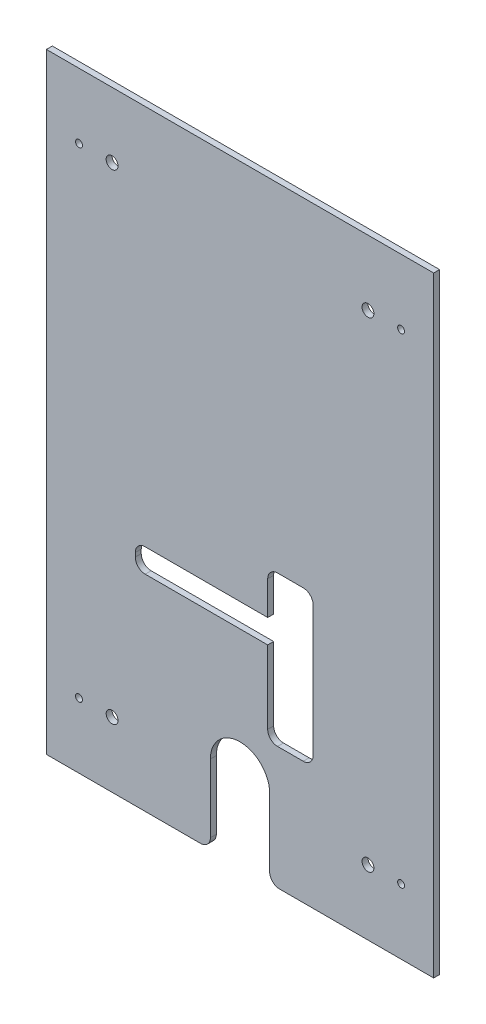
ISO-10303-21;
HEADER;
FILE_DESCRIPTION(('STEP AP214'),'2;1');
FILE_NAME('part.step','',(''),(''),'','','');
FILE_SCHEMA(('AUTOMOTIVE_DESIGN { 1 0 10303 214 1 1 1 1 }'));
ENDSEC;
DATA;
#1=APPLICATION_CONTEXT('core data for automotive mechanical design processes');
#2=APPLICATION_PROTOCOL_DEFINITION('international standard','automotive_design',2000,#1);
#3=PRODUCT_CONTEXT('',#1,'mechanical');
#4=PRODUCT('Part','Part','',(#3));
#5=PRODUCT_RELATED_PRODUCT_CATEGORY('part','',(#4));
#6=PRODUCT_DEFINITION_FORMATION('','',#4);
#7=PRODUCT_DEFINITION_CONTEXT('part definition',#1,'design');
#8=PRODUCT_DEFINITION('design','',#6,#7);
#9=PRODUCT_DEFINITION_SHAPE('','',#8);
#10=(LENGTH_UNIT() NAMED_UNIT(*) SI_UNIT(.MILLI.,.METRE.));
#11=(NAMED_UNIT(*) PLANE_ANGLE_UNIT() SI_UNIT($,.RADIAN.));
#12=(NAMED_UNIT(*) SI_UNIT($,.STERADIAN.) SOLID_ANGLE_UNIT());
#13=UNCERTAINTY_MEASURE_WITH_UNIT(LENGTH_MEASURE(1.E-05),#10,'distance_accuracy_value','');
#14=(GEOMETRIC_REPRESENTATION_CONTEXT(3) GLOBAL_UNCERTAINTY_ASSIGNED_CONTEXT((#13)) GLOBAL_UNIT_ASSIGNED_CONTEXT((#10,
#11,#12)) REPRESENTATION_CONTEXT('',''));
#15=CARTESIAN_POINT('',(0.,0.,0.));
#16=DIRECTION('',(0.,0.,1.));
#17=DIRECTION('',(1.,0.,0.));
#18=AXIS2_PLACEMENT_3D('',#15,#16,#17);
#19=CARTESIAN_POINT('',(98.,-154.5,3.));
#20=DIRECTION('',(0.,1.,0.));
#21=DIRECTION('',(0.,0.,1.));
#22=AXIS2_PLACEMENT_3D('',#19,#20,#21);
#23=PLANE('',#22);
#24=DIRECTION('',(1.,0.,0.));
#25=VECTOR('',#24,1.);
#26=CARTESIAN_POINT('',(98.,-154.5,0.));
#27=LINE('',#26,#25);
#28=CARTESIAN_POINT('',(-98.,-154.5,0.));
#29=VERTEX_POINT('',#28);
#30=CARTESIAN_POINT('',(-20.,-154.5,0.));
#31=VERTEX_POINT('',#30);
#32=EDGE_CURVE('E332',#29,#31,#27,.T.);
#33=ORIENTED_EDGE('',*,*,#32,.T.);
#34=DIRECTION('',(0.,0.,-1.));
#35=VECTOR('',#34,1.);
#36=CARTESIAN_POINT('',(-20.,-154.5,3.));
#37=LINE('',#36,#35);
#38=CARTESIAN_POINT('',(-20.,-154.5,3.));
#39=VERTEX_POINT('',#38);
#40=EDGE_CURVE('E365',#31,#39,#37,.F.);
#41=ORIENTED_EDGE('',*,*,#40,.T.);
#42=DIRECTION('',(1.,0.,0.));
#43=VECTOR('',#42,1.);
#44=CARTESIAN_POINT('',(98.,-154.5,3.));
#45=LINE('',#44,#43);
#46=CARTESIAN_POINT('',(-98.,-154.5,3.));
#47=VERTEX_POINT('',#46);
#48=EDGE_CURVE('E321',#47,#39,#45,.T.);
#49=ORIENTED_EDGE('',*,*,#48,.F.);
#50=DIRECTION('',(0.,0.,-1.));
#51=VECTOR('',#50,1.);
#52=CARTESIAN_POINT('',(-98.,-154.5,3.));
#53=LINE('',#52,#51);
#54=EDGE_CURVE('E346',#47,#29,#53,.T.);
#55=ORIENTED_EDGE('',*,*,#54,.T.);
#56=EDGE_LOOP('',(#33,#41,#49,#55));
#57=FACE_BOUND('',#56,.T.);
#58=ADVANCED_FACE('F39',(#57),#23,.F.);
#59=CARTESIAN_POINT('',(0.,0.,3.));
#60=DIRECTION('',(0.,0.,-1.));
#61=DIRECTION('',(-1.,0.,0.));
#62=AXIS2_PLACEMENT_3D('',#59,#60,#61);
#63=PLANE('',#62);
#64=DIRECTION('',(1.,0.,0.));
#65=VECTOR('',#64,1.);
#66=CARTESIAN_POINT('',(-53.,-50.5,3.));
#67=LINE('',#66,#65);
#68=CARTESIAN_POINT('',(-48.,-50.5,3.));
#69=VERTEX_POINT('',#68);
#70=CARTESIAN_POINT('',(14.,-50.5,3.));
#71=VERTEX_POINT('',#70);
#72=EDGE_CURVE('E229',#69,#71,#67,.T.);
#73=ORIENTED_EDGE('',*,*,#72,.F.);
#74=CARTESIAN_POINT('',(-48.,-45.5,3.));
#75=DIRECTION('',(0.,0.,-1.));
#76=DIRECTION('',(-1.,0.,0.));
#77=AXIS2_PLACEMENT_3D('',#74,#75,#76);
#78=CIRCLE('',#77,5.);
#79=CARTESIAN_POINT('',(-53.,-45.5,3.));
#80=VERTEX_POINT('',#79);
#81=EDGE_CURVE('E395',#69,#80,#78,.T.);
#82=ORIENTED_EDGE('',*,*,#81,.T.);
#83=DIRECTION('',(0.,-1.,0.));
#84=VECTOR('',#83,1.);
#85=CARTESIAN_POINT('',(-53.,-38.5,3.));
#86=LINE('',#85,#84);
#87=CARTESIAN_POINT('',(-53.,-43.5,3.));
#88=VERTEX_POINT('',#87);
#89=EDGE_CURVE('E226',#88,#80,#86,.T.);
#90=ORIENTED_EDGE('',*,*,#89,.F.);
#91=CARTESIAN_POINT('',(-48.,-43.5,3.));
#92=DIRECTION('',(0.,0.,-1.));
#93=DIRECTION('',(-1.,0.,0.));
#94=AXIS2_PLACEMENT_3D('',#91,#92,#93);
#95=CIRCLE('',#94,5.);
#96=CARTESIAN_POINT('',(-48.,-38.5,3.));
#97=VERTEX_POINT('',#96);
#98=EDGE_CURVE('E399',#88,#97,#95,.T.);
#99=ORIENTED_EDGE('',*,*,#98,.T.);
#100=DIRECTION('',(-1.,0.,0.));
#101=VECTOR('',#100,1.);
#102=CARTESIAN_POINT('',(-53.,-38.5,3.));
#103=LINE('',#102,#101);
#104=CARTESIAN_POINT('',(14.,-38.5,3.));
#105=VERTEX_POINT('',#104);
#106=EDGE_CURVE('E244',#105,#97,#103,.T.);
#107=ORIENTED_EDGE('',*,*,#106,.F.);
#108=DIRECTION('',(0.,-1.,0.));
#109=VECTOR('',#108,1.);
#110=CARTESIAN_POINT('',(14.,-16.5,3.));
#111=LINE('',#110,#109);
#112=CARTESIAN_POINT('',(14.,-21.5,3.));
#113=VERTEX_POINT('',#112);
#114=EDGE_CURVE('E211',#113,#105,#111,.T.);
#115=ORIENTED_EDGE('',*,*,#114,.F.);
#116=CARTESIAN_POINT('',(19.,-21.5,3.));
#117=DIRECTION('',(0.,0.,-1.));
#118=DIRECTION('',(-1.,0.,0.));
#119=AXIS2_PLACEMENT_3D('',#116,#117,#118);
#120=CIRCLE('',#119,5.);
#121=CARTESIAN_POINT('',(19.,-16.5,3.));
#122=VERTEX_POINT('',#121);
#123=EDGE_CURVE('E47',#113,#122,#120,.T.);
#124=ORIENTED_EDGE('',*,*,#123,.T.);
#125=DIRECTION('',(-1.,0.,0.));
#126=VECTOR('',#125,1.);
#127=CARTESIAN_POINT('',(37.,-16.5,3.));
#128=LINE('',#127,#126);
#129=CARTESIAN_POINT('',(32.,-16.5,3.));
#130=VERTEX_POINT('',#129);
#131=EDGE_CURVE('E240',#130,#122,#128,.T.);
#132=ORIENTED_EDGE('',*,*,#131,.F.);
#133=CARTESIAN_POINT('',(32.,-21.5,3.));
#134=DIRECTION('',(0.,0.,-1.));
#135=DIRECTION('',(-1.,0.,0.));
#136=AXIS2_PLACEMENT_3D('',#133,#134,#135);
#137=CIRCLE('',#136,5.);
#138=CARTESIAN_POINT('',(37.,-21.5,3.));
#139=VERTEX_POINT('',#138);
#140=EDGE_CURVE('E411',#130,#139,#137,.T.);
#141=ORIENTED_EDGE('',*,*,#140,.T.);
#142=DIRECTION('',(0.,1.,0.));
#143=VECTOR('',#142,1.);
#144=CARTESIAN_POINT('',(37.,-16.5,3.));
#145=LINE('',#144,#143);
#146=CARTESIAN_POINT('',(37.,-87.5,3.));
#147=VERTEX_POINT('',#146);
#148=EDGE_CURVE('E237',#147,#139,#145,.T.);
#149=ORIENTED_EDGE('',*,*,#148,.F.);
#150=CARTESIAN_POINT('',(32.,-87.5,3.));
#151=DIRECTION('',(0.,0.,-1.));
#152=DIRECTION('',(-1.,0.,0.));
#153=AXIS2_PLACEMENT_3D('',#150,#151,#152);
#154=CIRCLE('',#153,5.);
#155=CARTESIAN_POINT('',(32.,-92.5,3.));
#156=VERTEX_POINT('',#155);
#157=EDGE_CURVE('E407',#147,#156,#154,.T.);
#158=ORIENTED_EDGE('',*,*,#157,.T.);
#159=DIRECTION('',(1.,0.,0.));
#160=VECTOR('',#159,1.);
#161=CARTESIAN_POINT('',(37.,-92.5,3.));
#162=LINE('',#161,#160);
#163=CARTESIAN_POINT('',(19.,-92.5,3.));
#164=VERTEX_POINT('',#163);
#165=EDGE_CURVE('E234',#164,#156,#162,.T.);
#166=ORIENTED_EDGE('',*,*,#165,.F.);
#167=CARTESIAN_POINT('',(19.,-87.5,3.));
#168=DIRECTION('',(0.,0.,-1.));
#169=DIRECTION('',(-1.,0.,0.));
#170=AXIS2_PLACEMENT_3D('',#167,#168,#169);
#171=CIRCLE('',#170,5.);
#172=CARTESIAN_POINT('',(14.,-87.5,3.));
#173=VERTEX_POINT('',#172);
#174=EDGE_CURVE('E403',#164,#173,#171,.T.);
#175=ORIENTED_EDGE('',*,*,#174,.T.);
#176=DIRECTION('',(0.,-1.,0.));
#177=VECTOR('',#176,1.);
#178=CARTESIAN_POINT('',(14.,-50.5,3.));
#179=LINE('',#178,#177);
#180=EDGE_CURVE('E231',#71,#173,#179,.T.);
#181=ORIENTED_EDGE('',*,*,#180,.F.);
#182=EDGE_LOOP('',(#73,#82,#90,#99,#107,#115,#124,#132,#141,#149,#158,#166,#175,#181));
#183=FACE_BOUND('',#182,.T.);
#184=DIRECTION('',(0.,1.,0.));
#185=VECTOR('',#184,1.);
#186=CARTESIAN_POINT('',(15.,-154.5,3.));
#187=LINE('',#186,#185);
#188=CARTESIAN_POINT('',(15.,-149.5,3.));
#189=VERTEX_POINT('',#188);
#190=CARTESIAN_POINT('',(15.,-115.,3.));
#191=VERTEX_POINT('',#190);
#192=EDGE_CURVE('E252',#189,#191,#187,.T.);
#193=ORIENTED_EDGE('',*,*,#192,.F.);
#194=CARTESIAN_POINT('',(20.,-149.5,3.));
#195=DIRECTION('',(0.,0.,-1.));
#196=DIRECTION('',(-1.,0.,0.));
#197=AXIS2_PLACEMENT_3D('',#194,#195,#196);
#198=CIRCLE('',#197,5.);
#199=CARTESIAN_POINT('',(20.,-154.5,3.));
#200=VERTEX_POINT('',#199);
#201=EDGE_CURVE('E354',#189,#200,#198,.F.);
#202=ORIENTED_EDGE('',*,*,#201,.T.);
#203=CARTESIAN_POINT('',(98.,-154.5,3.));
#204=VERTEX_POINT('',#203);
#205=EDGE_CURVE('E319',#200,#204,#45,.T.);
#206=ORIENTED_EDGE('',*,*,#205,.T.);
#207=DIRECTION('',(0.,1.,0.));
#208=VECTOR('',#207,1.);
#209=CARTESIAN_POINT('',(98.,154.5,3.));
#210=LINE('',#209,#208);
#211=CARTESIAN_POINT('',(98.,154.5,3.));
#212=VERTEX_POINT('',#211);
#213=EDGE_CURVE('E324',#204,#212,#210,.T.);
#214=ORIENTED_EDGE('',*,*,#213,.T.);
#215=DIRECTION('',(-1.,0.,0.));
#216=VECTOR('',#215,1.);
#217=CARTESIAN_POINT('',(98.,154.5,3.));
#218=LINE('',#217,#216);
#219=CARTESIAN_POINT('',(-98.,154.5,3.));
#220=VERTEX_POINT('',#219);
#221=EDGE_CURVE('E326',#212,#220,#218,.T.);
#222=ORIENTED_EDGE('',*,*,#221,.T.);
#223=DIRECTION('',(0.,-1.,0.));
#224=VECTOR('',#223,1.);
#225=CARTESIAN_POINT('',(-98.,154.5,3.));
#226=LINE('',#225,#224);
#227=EDGE_CURVE('E316',#220,#47,#226,.T.);
#228=ORIENTED_EDGE('',*,*,#227,.T.);
#229=ORIENTED_EDGE('',*,*,#48,.T.);
#230=CARTESIAN_POINT('',(-20.,-149.5,3.));
#231=DIRECTION('',(0.,0.,-1.));
#232=DIRECTION('',(-1.,0.,0.));
#233=AXIS2_PLACEMENT_3D('',#230,#231,#232);
#234=CIRCLE('',#233,5.);
#235=CARTESIAN_POINT('',(-15.,-149.5,3.));
#236=VERTEX_POINT('',#235);
#237=EDGE_CURVE('E352',#39,#236,#234,.F.);
#238=ORIENTED_EDGE('',*,*,#237,.T.);
#239=DIRECTION('',(0.,-1.,0.));
#240=VECTOR('',#239,1.);
#241=CARTESIAN_POINT('',(-15.,-154.5,3.));
#242=LINE('',#241,#240);
#243=CARTESIAN_POINT('',(-15.,-115.,3.));
#244=VERTEX_POINT('',#243);
#245=EDGE_CURVE('E257',#244,#236,#242,.T.);
#246=ORIENTED_EDGE('',*,*,#245,.F.);
#247=CARTESIAN_POINT('',(0.,-115.,3.));
#248=DIRECTION('',(0.,0.,1.));
#249=DIRECTION('',(1.,0.,0.));
#250=AXIS2_PLACEMENT_3D('',#247,#248,#249);
#251=CIRCLE('',#250,15.);
#252=EDGE_CURVE('E254',#191,#244,#251,.T.);
#253=ORIENTED_EDGE('',*,*,#252,.F.);
#254=EDGE_LOOP('',(#193,#202,#206,#214,#222,#228,#229,#238,#246,#253));
#255=FACE_BOUND('',#254,.T.);
#256=CARTESIAN_POINT('',(-81.5,121.5,3.));
#257=DIRECTION('',(0.,0.,1.));
#258=DIRECTION('',(1.,0.,0.));
#259=AXIS2_PLACEMENT_3D('',#256,#257,#258);
#260=CIRCLE('',#259,1.75);
#261=CARTESIAN_POINT('',(-79.75,121.5,3.));
#262=VERTEX_POINT('',#261);
#263=EDGE_CURVE('E310',#262,#262,#260,.T.);
#264=ORIENTED_EDGE('',*,*,#263,.F.);
#265=EDGE_LOOP('',(#264));
#266=FACE_BOUND('',#265,.T.);
#267=CARTESIAN_POINT('',(81.5,121.5,3.));
#268=DIRECTION('',(0.,0.,1.));
#269=DIRECTION('',(-1.,0.,0.));
#270=AXIS2_PLACEMENT_3D('',#267,#268,#269);
#271=CIRCLE('',#270,1.75);
#272=CARTESIAN_POINT('',(79.75,121.5,3.));
#273=VERTEX_POINT('',#272);
#274=EDGE_CURVE('E304',#273,#273,#271,.T.);
#275=ORIENTED_EDGE('',*,*,#274,.F.);
#276=EDGE_LOOP('',(#275));
#277=FACE_BOUND('',#276,.T.);
#278=CARTESIAN_POINT('',(81.5,-121.5,3.));
#279=DIRECTION('',(0.,0.,1.));
#280=DIRECTION('',(1.,0.,0.));
#281=AXIS2_PLACEMENT_3D('',#278,#279,#280);
#282=CIRCLE('',#281,1.75);
#283=CARTESIAN_POINT('',(83.25,-121.5,3.));
#284=VERTEX_POINT('',#283);
#285=EDGE_CURVE('E298',#284,#284,#282,.T.);
#286=ORIENTED_EDGE('',*,*,#285,.F.);
#287=EDGE_LOOP('',(#286));
#288=FACE_BOUND('',#287,.T.);
#289=CARTESIAN_POINT('',(-81.5,-121.5,3.));
#290=DIRECTION('',(0.,0.,1.));
#291=DIRECTION('',(-1.,0.,0.));
#292=AXIS2_PLACEMENT_3D('',#289,#290,#291);
#293=CIRCLE('',#292,1.75);
#294=CARTESIAN_POINT('',(-83.25,-121.5,3.));
#295=VERTEX_POINT('',#294);
#296=EDGE_CURVE('E292',#295,#295,#293,.T.);
#297=ORIENTED_EDGE('',*,*,#296,.F.);
#298=EDGE_LOOP('',(#297));
#299=FACE_BOUND('',#298,.T.);
#300=CARTESIAN_POINT('',(64.75,121.5,3.));
#301=DIRECTION('',(0.,0.,1.));
#302=DIRECTION('',(1.,0.,0.));
#303=AXIS2_PLACEMENT_3D('',#300,#301,#302);
#304=CIRCLE('',#303,3.00000000000001);
#305=CARTESIAN_POINT('',(67.75,121.5,3.));
#306=VERTEX_POINT('',#305);
#307=EDGE_CURVE('E286',#306,#306,#304,.T.);
#308=ORIENTED_EDGE('',*,*,#307,.F.);
#309=EDGE_LOOP('',(#308));
#310=FACE_BOUND('',#309,.T.);
#311=CARTESIAN_POINT('',(-64.7499999999999,121.5,3.));
#312=DIRECTION('',(0.,0.,1.));
#313=DIRECTION('',(-1.,0.,0.));
#314=AXIS2_PLACEMENT_3D('',#311,#312,#313);
#315=CIRCLE('',#314,3.00000000000001);
#316=CARTESIAN_POINT('',(-67.7499999999999,121.5,3.));
#317=VERTEX_POINT('',#316);
#318=EDGE_CURVE('E280',#317,#317,#315,.T.);
#319=ORIENTED_EDGE('',*,*,#318,.F.);
#320=EDGE_LOOP('',(#319));
#321=FACE_BOUND('',#320,.T.);
#322=CARTESIAN_POINT('',(-64.7499999999999,-121.5,3.));
#323=DIRECTION('',(0.,0.,1.));
#324=DIRECTION('',(1.,0.,0.));
#325=AXIS2_PLACEMENT_3D('',#322,#323,#324);
#326=CIRCLE('',#325,3.00000000000001);
#327=CARTESIAN_POINT('',(-61.7499999999999,-121.5,3.));
#328=VERTEX_POINT('',#327);
#329=EDGE_CURVE('E274',#328,#328,#326,.T.);
#330=ORIENTED_EDGE('',*,*,#329,.F.);
#331=EDGE_LOOP('',(#330));
#332=FACE_BOUND('',#331,.T.);
#333=CARTESIAN_POINT('',(64.7500000000001,-121.5,3.));
#334=DIRECTION('',(0.,0.,1.));
#335=DIRECTION('',(-1.,0.,0.));
#336=AXIS2_PLACEMENT_3D('',#333,#334,#335);
#337=CIRCLE('',#336,3.00000000000001);
#338=CARTESIAN_POINT('',(61.75,-121.5,3.));
#339=VERTEX_POINT('',#338);
#340=EDGE_CURVE('E268',#339,#339,#337,.T.);
#341=ORIENTED_EDGE('',*,*,#340,.F.);
#342=EDGE_LOOP('',(#341));
#343=FACE_BOUND('',#342,.T.);
#344=ADVANCED_FACE('F417',(#183,#255,#266,#277,#288,#299,#310,#321,#332,#343),#63,.F.);
#345=CARTESIAN_POINT('',(0.,0.,0.));
#346=DIRECTION('',(0.,0.,-1.));
#347=DIRECTION('',(-1.,0.,0.));
#348=AXIS2_PLACEMENT_3D('',#345,#346,#347);
#349=PLANE('',#348);
#350=DIRECTION('',(-1.,0.,0.));
#351=VECTOR('',#350,1.);
#352=CARTESIAN_POINT('',(-53.,-38.5,0.));
#353=LINE('',#352,#351);
#354=CARTESIAN_POINT('',(14.,-38.5,0.));
#355=VERTEX_POINT('',#354);
#356=CARTESIAN_POINT('',(-48.,-38.5,0.));
#357=VERTEX_POINT('',#356);
#358=EDGE_CURVE('E202',#355,#357,#353,.T.);
#359=ORIENTED_EDGE('',*,*,#358,.T.);
#360=CARTESIAN_POINT('',(-48.,-43.5,0.));
#361=DIRECTION('',(0.,0.,-1.));
#362=DIRECTION('',(-1.,0.,0.));
#363=AXIS2_PLACEMENT_3D('',#360,#361,#362);
#364=CIRCLE('',#363,5.);
#365=CARTESIAN_POINT('',(-53.,-43.5,0.));
#366=VERTEX_POINT('',#365);
#367=EDGE_CURVE('E401',#357,#366,#364,.F.);
#368=ORIENTED_EDGE('',*,*,#367,.T.);
#369=DIRECTION('',(0.,-1.,0.));
#370=VECTOR('',#369,1.);
#371=CARTESIAN_POINT('',(-53.,-38.5,0.));
#372=LINE('',#371,#370);
#373=CARTESIAN_POINT('',(-53.,-45.5,0.));
#374=VERTEX_POINT('',#373);
#375=EDGE_CURVE('E245',#366,#374,#372,.T.);
#376=ORIENTED_EDGE('',*,*,#375,.T.);
#377=CARTESIAN_POINT('',(-48.,-45.5,0.));
#378=DIRECTION('',(0.,0.,-1.));
#379=DIRECTION('',(-1.,0.,0.));
#380=AXIS2_PLACEMENT_3D('',#377,#378,#379);
#381=CIRCLE('',#380,5.);
#382=CARTESIAN_POINT('',(-48.,-50.5,0.));
#383=VERTEX_POINT('',#382);
#384=EDGE_CURVE('E397',#374,#383,#381,.F.);
#385=ORIENTED_EDGE('',*,*,#384,.T.);
#386=DIRECTION('',(1.,0.,0.));
#387=VECTOR('',#386,1.);
#388=CARTESIAN_POINT('',(-53.,-50.5,0.));
#389=LINE('',#388,#387);
#390=CARTESIAN_POINT('',(14.,-50.5,0.));
#391=VERTEX_POINT('',#390);
#392=EDGE_CURVE('E860',#383,#391,#389,.T.);
#393=ORIENTED_EDGE('',*,*,#392,.T.);
#394=DIRECTION('',(0.,-1.,0.));
#395=VECTOR('',#394,1.);
#396=CARTESIAN_POINT('',(14.,-50.5,0.));
#397=LINE('',#396,#395);
#398=CARTESIAN_POINT('',(14.,-87.5,0.));
#399=VERTEX_POINT('',#398);
#400=EDGE_CURVE('E855',#391,#399,#397,.T.);
#401=ORIENTED_EDGE('',*,*,#400,.T.);
#402=CARTESIAN_POINT('',(19.,-87.5,0.));
#403=DIRECTION('',(0.,0.,-1.));
#404=DIRECTION('',(-1.,0.,0.));
#405=AXIS2_PLACEMENT_3D('',#402,#403,#404);
#406=CIRCLE('',#405,5.);
#407=CARTESIAN_POINT('',(19.,-92.5,0.));
#408=VERTEX_POINT('',#407);
#409=EDGE_CURVE('E405',#399,#408,#406,.F.);
#410=ORIENTED_EDGE('',*,*,#409,.T.);
#411=DIRECTION('',(1.,0.,0.));
#412=VECTOR('',#411,1.);
#413=CARTESIAN_POINT('',(37.,-92.5,0.));
#414=LINE('',#413,#412);
#415=CARTESIAN_POINT('',(32.,-92.5,0.));
#416=VERTEX_POINT('',#415);
#417=EDGE_CURVE('E851',#408,#416,#414,.T.);
#418=ORIENTED_EDGE('',*,*,#417,.T.);
#419=CARTESIAN_POINT('',(32.,-87.5,0.));
#420=DIRECTION('',(0.,0.,-1.));
#421=DIRECTION('',(-1.,0.,0.));
#422=AXIS2_PLACEMENT_3D('',#419,#420,#421);
#423=CIRCLE('',#422,5.);
#424=CARTESIAN_POINT('',(37.,-87.5,0.));
#425=VERTEX_POINT('',#424);
#426=EDGE_CURVE('E409',#416,#425,#423,.F.);
#427=ORIENTED_EDGE('',*,*,#426,.T.);
#428=DIRECTION('',(0.,1.,0.));
#429=VECTOR('',#428,1.);
#430=CARTESIAN_POINT('',(37.,-16.5,0.));
#431=LINE('',#430,#429);
#432=CARTESIAN_POINT('',(37.,-21.5,0.));
#433=VERTEX_POINT('',#432);
#434=EDGE_CURVE('E848',#425,#433,#431,.T.);
#435=ORIENTED_EDGE('',*,*,#434,.T.);
#436=CARTESIAN_POINT('',(32.,-21.5,0.));
#437=DIRECTION('',(0.,0.,-1.));
#438=DIRECTION('',(-1.,0.,0.));
#439=AXIS2_PLACEMENT_3D('',#436,#437,#438);
#440=CIRCLE('',#439,5.);
#441=CARTESIAN_POINT('',(32.,-16.5,0.));
#442=VERTEX_POINT('',#441);
#443=EDGE_CURVE('E413',#433,#442,#440,.F.);
#444=ORIENTED_EDGE('',*,*,#443,.T.);
#445=DIRECTION('',(-1.,0.,0.));
#446=VECTOR('',#445,1.);
#447=CARTESIAN_POINT('',(37.,-16.5,0.));
#448=LINE('',#447,#446);
#449=CARTESIAN_POINT('',(19.,-16.5,0.));
#450=VERTEX_POINT('',#449);
#451=EDGE_CURVE('E205',#442,#450,#448,.T.);
#452=ORIENTED_EDGE('',*,*,#451,.T.);
#453=CARTESIAN_POINT('',(19.,-21.5,0.));
#454=DIRECTION('',(0.,0.,-1.));
#455=DIRECTION('',(-1.,0.,0.));
#456=AXIS2_PLACEMENT_3D('',#453,#454,#455);
#457=CIRCLE('',#456,5.);
#458=CARTESIAN_POINT('',(14.,-21.5,0.));
#459=VERTEX_POINT('',#458);
#460=EDGE_CURVE('E11',#450,#459,#457,.F.);
#461=ORIENTED_EDGE('',*,*,#460,.T.);
#462=DIRECTION('',(0.,-1.,0.));
#463=VECTOR('',#462,1.);
#464=CARTESIAN_POINT('',(14.,-16.5,0.));
#465=LINE('',#464,#463);
#466=EDGE_CURVE('E197',#459,#355,#465,.T.);
#467=ORIENTED_EDGE('',*,*,#466,.T.);
#468=EDGE_LOOP('',(#359,#368,#376,#385,#393,#401,#410,#418,#427,#435,#444,#452,#461,#467));
#469=FACE_BOUND('',#468,.T.);
#470=CARTESIAN_POINT('',(20.,-154.5,0.));
#471=VERTEX_POINT('',#470);
#472=CARTESIAN_POINT('',(98.,-154.5,0.));
#473=VERTEX_POINT('',#472);
#474=EDGE_CURVE('E331',#471,#473,#27,.T.);
#475=ORIENTED_EDGE('',*,*,#474,.F.);
#476=CARTESIAN_POINT('',(20.,-149.5,0.));
#477=DIRECTION('',(0.,0.,-1.));
#478=DIRECTION('',(-1.,0.,0.));
#479=AXIS2_PLACEMENT_3D('',#476,#477,#478);
#480=CIRCLE('',#479,5.);
#481=CARTESIAN_POINT('',(15.,-149.5,0.));
#482=VERTEX_POINT('',#481);
#483=EDGE_CURVE('E360',#471,#482,#480,.T.);
#484=ORIENTED_EDGE('',*,*,#483,.T.);
#485=DIRECTION('',(0.,1.,0.));
#486=VECTOR('',#485,1.);
#487=CARTESIAN_POINT('',(15.,-154.5,0.));
#488=LINE('',#487,#486);
#489=CARTESIAN_POINT('',(15.,-115.,0.));
#490=VERTEX_POINT('',#489);
#491=EDGE_CURVE('E263',#482,#490,#488,.T.);
#492=ORIENTED_EDGE('',*,*,#491,.T.);
#493=CARTESIAN_POINT('',(0.,-115.,0.));
#494=DIRECTION('',(0.,0.,-1.));
#495=DIRECTION('',(-1.,0.,0.));
#496=AXIS2_PLACEMENT_3D('',#493,#494,#495);
#497=CIRCLE('',#496,15.);
#498=CARTESIAN_POINT('',(-15.,-115.,0.));
#499=VERTEX_POINT('',#498);
#500=EDGE_CURVE('E215',#490,#499,#497,.F.);
#501=ORIENTED_EDGE('',*,*,#500,.T.);
#502=DIRECTION('',(0.,-1.,0.));
#503=VECTOR('',#502,1.);
#504=CARTESIAN_POINT('',(-15.,-154.5,0.));
#505=LINE('',#504,#503);
#506=CARTESIAN_POINT('',(-15.,-149.5,0.));
#507=VERTEX_POINT('',#506);
#508=EDGE_CURVE('E249',#499,#507,#505,.T.);
#509=ORIENTED_EDGE('',*,*,#508,.T.);
#510=CARTESIAN_POINT('',(-20.,-149.5,0.));
#511=DIRECTION('',(0.,0.,-1.));
#512=DIRECTION('',(-1.,0.,0.));
#513=AXIS2_PLACEMENT_3D('',#510,#511,#512);
#514=CIRCLE('',#513,5.);
#515=EDGE_CURVE('E358',#507,#31,#514,.T.);
#516=ORIENTED_EDGE('',*,*,#515,.T.);
#517=ORIENTED_EDGE('',*,*,#32,.F.);
#518=DIRECTION('',(0.,-1.,0.));
#519=VECTOR('',#518,1.);
#520=CARTESIAN_POINT('',(-98.,154.5,0.));
#521=LINE('',#520,#519);
#522=CARTESIAN_POINT('',(-98.,154.5,0.));
#523=VERTEX_POINT('',#522);
#524=EDGE_CURVE('E313',#523,#29,#521,.T.);
#525=ORIENTED_EDGE('',*,*,#524,.F.);
#526=DIRECTION('',(-1.,0.,0.));
#527=VECTOR('',#526,1.);
#528=CARTESIAN_POINT('',(98.,154.5,0.));
#529=LINE('',#528,#527);
#530=CARTESIAN_POINT('',(98.,154.5,0.));
#531=VERTEX_POINT('',#530);
#532=EDGE_CURVE('E320',#531,#523,#529,.T.);
#533=ORIENTED_EDGE('',*,*,#532,.F.);
#534=DIRECTION('',(0.,1.,0.));
#535=VECTOR('',#534,1.);
#536=CARTESIAN_POINT('',(98.,154.5,0.));
#537=LINE('',#536,#535);
#538=EDGE_CURVE('E335',#473,#531,#537,.T.);
#539=ORIENTED_EDGE('',*,*,#538,.F.);
#540=EDGE_LOOP('',(#475,#484,#492,#501,#509,#516,#517,#525,#533,#539));
#541=FACE_BOUND('',#540,.T.);
#542=CARTESIAN_POINT('',(-64.7499999999999,-121.5,0.));
#543=DIRECTION('',(0.,0.,1.));
#544=DIRECTION('',(1.,0.,0.));
#545=AXIS2_PLACEMENT_3D('',#542,#543,#544);
#546=CIRCLE('',#545,3.00000000000001);
#547=CARTESIAN_POINT('',(-61.7499999999999,-121.5,0.));
#548=VERTEX_POINT('',#547);
#549=EDGE_CURVE('E271',#548,#548,#546,.T.);
#550=ORIENTED_EDGE('',*,*,#549,.T.);
#551=EDGE_LOOP('',(#550));
#552=FACE_BOUND('',#551,.T.);
#553=CARTESIAN_POINT('',(64.75,121.5,0.));
#554=DIRECTION('',(0.,0.,1.));
#555=DIRECTION('',(1.,0.,0.));
#556=AXIS2_PLACEMENT_3D('',#553,#554,#555);
#557=CIRCLE('',#556,3.00000000000001);
#558=CARTESIAN_POINT('',(67.75,121.5,0.));
#559=VERTEX_POINT('',#558);
#560=EDGE_CURVE('E283',#559,#559,#557,.T.);
#561=ORIENTED_EDGE('',*,*,#560,.T.);
#562=EDGE_LOOP('',(#561));
#563=FACE_BOUND('',#562,.T.);
#564=CARTESIAN_POINT('',(81.5,-121.5,0.));
#565=DIRECTION('',(0.,0.,1.));
#566=DIRECTION('',(1.,0.,0.));
#567=AXIS2_PLACEMENT_3D('',#564,#565,#566);
#568=CIRCLE('',#567,1.75);
#569=CARTESIAN_POINT('',(83.25,-121.5,0.));
#570=VERTEX_POINT('',#569);
#571=EDGE_CURVE('E295',#570,#570,#568,.T.);
#572=ORIENTED_EDGE('',*,*,#571,.T.);
#573=EDGE_LOOP('',(#572));
#574=FACE_BOUND('',#573,.T.);
#575=CARTESIAN_POINT('',(-81.5,121.5,0.));
#576=DIRECTION('',(0.,0.,1.));
#577=DIRECTION('',(1.,0.,0.));
#578=AXIS2_PLACEMENT_3D('',#575,#576,#577);
#579=CIRCLE('',#578,1.75);
#580=CARTESIAN_POINT('',(-79.75,121.5,0.));
#581=VERTEX_POINT('',#580);
#582=EDGE_CURVE('E307',#581,#581,#579,.T.);
#583=ORIENTED_EDGE('',*,*,#582,.T.);
#584=EDGE_LOOP('',(#583));
#585=FACE_BOUND('',#584,.T.);
#586=CARTESIAN_POINT('',(81.5,121.5,0.));
#587=DIRECTION('',(0.,0.,1.));
#588=DIRECTION('',(-1.,0.,0.));
#589=AXIS2_PLACEMENT_3D('',#586,#587,#588);
#590=CIRCLE('',#589,1.75);
#591=CARTESIAN_POINT('',(79.75,121.5,0.));
#592=VERTEX_POINT('',#591);
#593=EDGE_CURVE('E301',#592,#592,#590,.T.);
#594=ORIENTED_EDGE('',*,*,#593,.T.);
#595=EDGE_LOOP('',(#594));
#596=FACE_BOUND('',#595,.T.);
#597=CARTESIAN_POINT('',(-81.5,-121.5,0.));
#598=DIRECTION('',(0.,0.,1.));
#599=DIRECTION('',(-1.,0.,0.));
#600=AXIS2_PLACEMENT_3D('',#597,#598,#599);
#601=CIRCLE('',#600,1.75);
#602=CARTESIAN_POINT('',(-83.25,-121.5,0.));
#603=VERTEX_POINT('',#602);
#604=EDGE_CURVE('E289',#603,#603,#601,.T.);
#605=ORIENTED_EDGE('',*,*,#604,.T.);
#606=EDGE_LOOP('',(#605));
#607=FACE_BOUND('',#606,.T.);
#608=CARTESIAN_POINT('',(-64.7499999999999,121.5,0.));
#609=DIRECTION('',(0.,0.,1.));
#610=DIRECTION('',(-1.,0.,0.));
#611=AXIS2_PLACEMENT_3D('',#608,#609,#610);
#612=CIRCLE('',#611,3.00000000000001);
#613=CARTESIAN_POINT('',(-67.7499999999999,121.5,0.));
#614=VERTEX_POINT('',#613);
#615=EDGE_CURVE('E277',#614,#614,#612,.T.);
#616=ORIENTED_EDGE('',*,*,#615,.T.);
#617=EDGE_LOOP('',(#616));
#618=FACE_BOUND('',#617,.T.);
#619=CARTESIAN_POINT('',(64.7500000000001,-121.5,0.));
#620=DIRECTION('',(0.,0.,1.));
#621=DIRECTION('',(-1.,0.,0.));
#622=AXIS2_PLACEMENT_3D('',#619,#620,#621);
#623=CIRCLE('',#622,3.00000000000001);
#624=CARTESIAN_POINT('',(61.75,-121.5,0.));
#625=VERTEX_POINT('',#624);
#626=EDGE_CURVE('E267',#625,#625,#623,.T.);
#627=ORIENTED_EDGE('',*,*,#626,.T.);
#628=EDGE_LOOP('',(#627));
#629=FACE_BOUND('',#628,.T.);
#630=ADVANCED_FACE('F199',(#469,#541,#552,#563,#574,#585,#596,#607,#618,#629),#349,.T.);
#631=CARTESIAN_POINT('',(-98.,154.5,3.));
#632=DIRECTION('',(1.,0.,0.));
#633=DIRECTION('',(0.,0.,-1.));
#634=AXIS2_PLACEMENT_3D('',#631,#632,#633);
#635=PLANE('',#634);
#636=ORIENTED_EDGE('',*,*,#524,.T.);
#637=ORIENTED_EDGE('',*,*,#54,.F.);
#638=ORIENTED_EDGE('',*,*,#227,.F.);
#639=DIRECTION('',(0.,0.,-1.));
#640=VECTOR('',#639,1.);
#641=CARTESIAN_POINT('',(-98.,154.5,3.));
#642=LINE('',#641,#640);
#643=EDGE_CURVE('E328',#220,#523,#642,.T.);
#644=ORIENTED_EDGE('',*,*,#643,.T.);
#645=EDGE_LOOP('',(#636,#637,#638,#644));
#646=FACE_BOUND('',#645,.T.);
#647=ADVANCED_FACE('F443',(#646),#635,.F.);
#648=ORIENTED_EDGE('',*,*,#205,.F.);
#649=DIRECTION('',(0.,0.,1.));
#650=VECTOR('',#649,1.);
#651=CARTESIAN_POINT('',(20.,-154.5,3.));
#652=LINE('',#651,#650);
#653=EDGE_CURVE('E356',#200,#471,#652,.F.);
#654=ORIENTED_EDGE('',*,*,#653,.T.);
#655=ORIENTED_EDGE('',*,*,#474,.T.);
#656=DIRECTION('',(0.,0.,-1.));
#657=VECTOR('',#656,1.);
#658=CARTESIAN_POINT('',(98.,-154.5,3.));
#659=LINE('',#658,#657);
#660=EDGE_CURVE('E343',#204,#473,#659,.T.);
#661=ORIENTED_EDGE('',*,*,#660,.F.);
#662=EDGE_LOOP('',(#648,#654,#655,#661));
#663=FACE_BOUND('',#662,.T.);
#664=ADVANCED_FACE('F433',(#663),#23,.F.);
#665=CARTESIAN_POINT('',(98.,154.5,3.));
#666=DIRECTION('',(-1.,0.,0.));
#667=DIRECTION('',(0.,0.,1.));
#668=AXIS2_PLACEMENT_3D('',#665,#666,#667);
#669=PLANE('',#668);
#670=ORIENTED_EDGE('',*,*,#538,.T.);
#671=DIRECTION('',(0.,0.,-1.));
#672=VECTOR('',#671,1.);
#673=CARTESIAN_POINT('',(98.,154.5,3.));
#674=LINE('',#673,#672);
#675=EDGE_CURVE('E340',#212,#531,#674,.T.);
#676=ORIENTED_EDGE('',*,*,#675,.F.);
#677=ORIENTED_EDGE('',*,*,#213,.F.);
#678=ORIENTED_EDGE('',*,*,#660,.T.);
#679=EDGE_LOOP('',(#670,#676,#677,#678));
#680=FACE_BOUND('',#679,.T.);
#681=ADVANCED_FACE('F442',(#680),#669,.F.);
#682=CARTESIAN_POINT('',(98.,154.5,3.));
#683=DIRECTION('',(0.,-1.,0.));
#684=DIRECTION('',(0.,0.,-1.));
#685=AXIS2_PLACEMENT_3D('',#682,#683,#684);
#686=PLANE('',#685);
#687=ORIENTED_EDGE('',*,*,#532,.T.);
#688=ORIENTED_EDGE('',*,*,#643,.F.);
#689=ORIENTED_EDGE('',*,*,#221,.F.);
#690=ORIENTED_EDGE('',*,*,#675,.T.);
#691=EDGE_LOOP('',(#687,#688,#689,#690));
#692=FACE_BOUND('',#691,.T.);
#693=ADVANCED_FACE('F449',(#692),#686,.F.);
#694=CARTESIAN_POINT('',(-81.5,121.5,3.));
#695=DIRECTION('',(0.,0.,-1.));
#696=DIRECTION('',(-1.,0.,0.));
#697=AXIS2_PLACEMENT_3D('',#694,#695,#696);
#698=CYLINDRICAL_SURFACE('',#697,1.75);
#699=ORIENTED_EDGE('',*,*,#263,.T.);
#700=EDGE_LOOP('',(#699));
#701=FACE_BOUND('',#700,.T.);
#702=ORIENTED_EDGE('',*,*,#582,.F.);
#703=EDGE_LOOP('',(#702));
#704=FACE_BOUND('',#703,.T.);
#705=ADVANCED_FACE('F491',(#701,#704),#698,.F.);
#706=CARTESIAN_POINT('',(81.5,121.5,3.));
#707=DIRECTION('',(0.,0.,-1.));
#708=DIRECTION('',(-1.,0.,0.));
#709=AXIS2_PLACEMENT_3D('',#706,#707,#708);
#710=CYLINDRICAL_SURFACE('',#709,1.75);
#711=ORIENTED_EDGE('',*,*,#274,.T.);
#712=EDGE_LOOP('',(#711));
#713=FACE_BOUND('',#712,.T.);
#714=ORIENTED_EDGE('',*,*,#593,.F.);
#715=EDGE_LOOP('',(#714));
#716=FACE_BOUND('',#715,.T.);
#717=ADVANCED_FACE('F496',(#713,#716),#710,.F.);
#718=CARTESIAN_POINT('',(81.5,-121.5,3.));
#719=DIRECTION('',(0.,0.,-1.));
#720=DIRECTION('',(-1.,0.,0.));
#721=AXIS2_PLACEMENT_3D('',#718,#719,#720);
#722=CYLINDRICAL_SURFACE('',#721,1.75);
#723=ORIENTED_EDGE('',*,*,#285,.T.);
#724=EDGE_LOOP('',(#723));
#725=FACE_BOUND('',#724,.T.);
#726=ORIENTED_EDGE('',*,*,#571,.F.);
#727=EDGE_LOOP('',(#726));
#728=FACE_BOUND('',#727,.T.);
#729=ADVANCED_FACE('F504',(#725,#728),#722,.F.);
#730=CARTESIAN_POINT('',(-81.5,-121.5,3.));
#731=DIRECTION('',(0.,0.,-1.));
#732=DIRECTION('',(-1.,0.,0.));
#733=AXIS2_PLACEMENT_3D('',#730,#731,#732);
#734=CYLINDRICAL_SURFACE('',#733,1.75);
#735=ORIENTED_EDGE('',*,*,#296,.T.);
#736=EDGE_LOOP('',(#735));
#737=FACE_BOUND('',#736,.T.);
#738=ORIENTED_EDGE('',*,*,#604,.F.);
#739=EDGE_LOOP('',(#738));
#740=FACE_BOUND('',#739,.T.);
#741=ADVANCED_FACE('F508',(#737,#740),#734,.F.);
#742=CARTESIAN_POINT('',(64.75,121.5,3.));
#743=DIRECTION('',(0.,0.,-1.));
#744=DIRECTION('',(-1.,0.,0.));
#745=AXIS2_PLACEMENT_3D('',#742,#743,#744);
#746=CYLINDRICAL_SURFACE('',#745,3.00000000000001);
#747=ORIENTED_EDGE('',*,*,#307,.T.);
#748=EDGE_LOOP('',(#747));
#749=FACE_BOUND('',#748,.T.);
#750=ORIENTED_EDGE('',*,*,#560,.F.);
#751=EDGE_LOOP('',(#750));
#752=FACE_BOUND('',#751,.T.);
#753=ADVANCED_FACE('F512',(#749,#752),#746,.F.);
#754=CARTESIAN_POINT('',(-64.7499999999999,121.5,3.));
#755=DIRECTION('',(0.,0.,-1.));
#756=DIRECTION('',(-1.,0.,0.));
#757=AXIS2_PLACEMENT_3D('',#754,#755,#756);
#758=CYLINDRICAL_SURFACE('',#757,3.00000000000001);
#759=ORIENTED_EDGE('',*,*,#318,.T.);
#760=EDGE_LOOP('',(#759));
#761=FACE_BOUND('',#760,.T.);
#762=ORIENTED_EDGE('',*,*,#615,.F.);
#763=EDGE_LOOP('',(#762));
#764=FACE_BOUND('',#763,.T.);
#765=ADVANCED_FACE('F516',(#761,#764),#758,.F.);
#766=CARTESIAN_POINT('',(-64.7499999999999,-121.5,3.));
#767=DIRECTION('',(0.,0.,-1.));
#768=DIRECTION('',(-1.,0.,0.));
#769=AXIS2_PLACEMENT_3D('',#766,#767,#768);
#770=CYLINDRICAL_SURFACE('',#769,3.00000000000001);
#771=ORIENTED_EDGE('',*,*,#329,.T.);
#772=EDGE_LOOP('',(#771));
#773=FACE_BOUND('',#772,.T.);
#774=ORIENTED_EDGE('',*,*,#549,.F.);
#775=EDGE_LOOP('',(#774));
#776=FACE_BOUND('',#775,.T.);
#777=ADVANCED_FACE('F520',(#773,#776),#770,.F.);
#778=CARTESIAN_POINT('',(64.7500000000001,-121.5,3.));
#779=DIRECTION('',(0.,0.,-1.));
#780=DIRECTION('',(-1.,0.,0.));
#781=AXIS2_PLACEMENT_3D('',#778,#779,#780);
#782=CYLINDRICAL_SURFACE('',#781,3.00000000000001);
#783=ORIENTED_EDGE('',*,*,#340,.T.);
#784=EDGE_LOOP('',(#783));
#785=FACE_BOUND('',#784,.T.);
#786=ORIENTED_EDGE('',*,*,#626,.F.);
#787=EDGE_LOOP('',(#786));
#788=FACE_BOUND('',#787,.T.);
#789=ADVANCED_FACE('F524',(#785,#788),#782,.F.);
#790=CARTESIAN_POINT('',(-15.,-154.5,-0.00100000000000013));
#791=DIRECTION('',(-1.,0.,0.));
#792=DIRECTION('',(0.,0.,1.));
#793=AXIS2_PLACEMENT_3D('',#790,#791,#792);
#794=PLANE('',#793);
#795=ORIENTED_EDGE('',*,*,#245,.T.);
#796=DIRECTION('',(0.,0.,-1.));
#797=VECTOR('',#796,1.);
#798=CARTESIAN_POINT('',(-15.,-149.5,-0.00100000000000013));
#799=LINE('',#798,#797);
#800=EDGE_CURVE('E362',#236,#507,#799,.T.);
#801=ORIENTED_EDGE('',*,*,#800,.T.);
#802=ORIENTED_EDGE('',*,*,#508,.F.);
#803=DIRECTION('',(0.,0.,1.));
#804=VECTOR('',#803,1.);
#805=CARTESIAN_POINT('',(-15.,-115.,-0.00100000000000013));
#806=LINE('',#805,#804);
#807=EDGE_CURVE('E261',#499,#244,#806,.T.);
#808=ORIENTED_EDGE('',*,*,#807,.T.);
#809=EDGE_LOOP('',(#795,#801,#802,#808));
#810=FACE_BOUND('',#809,.T.);
#811=ADVANCED_FACE('F474',(#810),#794,.F.);
#812=CARTESIAN_POINT('',(0.,-115.,-0.00100000000000013));
#813=DIRECTION('',(0.,0.,1.));
#814=DIRECTION('',(1.,0.,0.));
#815=AXIS2_PLACEMENT_3D('',#812,#813,#814);
#816=CYLINDRICAL_SURFACE('',#815,15.);
#817=DIRECTION('',(0.,0.,1.));
#818=VECTOR('',#817,1.);
#819=CARTESIAN_POINT('',(15.,-115.,-0.00100000000000013));
#820=LINE('',#819,#818);
#821=EDGE_CURVE('E260',#490,#191,#820,.T.);
#822=ORIENTED_EDGE('',*,*,#821,.T.);
#823=ORIENTED_EDGE('',*,*,#252,.T.);
#824=ORIENTED_EDGE('',*,*,#807,.F.);
#825=ORIENTED_EDGE('',*,*,#500,.F.);
#826=EDGE_LOOP('',(#822,#823,#824,#825));
#827=FACE_BOUND('',#826,.T.);
#828=ADVANCED_FACE('F471',(#827),#816,.F.);
#829=CARTESIAN_POINT('',(15.,-154.5,-0.00100000000000013));
#830=DIRECTION('',(1.,0.,0.));
#831=DIRECTION('',(0.,0.,-1.));
#832=AXIS2_PLACEMENT_3D('',#829,#830,#831);
#833=PLANE('',#832);
#834=ORIENTED_EDGE('',*,*,#491,.F.);
#835=DIRECTION('',(0.,0.,1.));
#836=VECTOR('',#835,1.);
#837=CARTESIAN_POINT('',(15.,-149.5,-0.00100000000000013));
#838=LINE('',#837,#836);
#839=EDGE_CURVE('E349',#482,#189,#838,.T.);
#840=ORIENTED_EDGE('',*,*,#839,.T.);
#841=ORIENTED_EDGE('',*,*,#192,.T.);
#842=ORIENTED_EDGE('',*,*,#821,.F.);
#843=EDGE_LOOP('',(#834,#840,#841,#842));
#844=FACE_BOUND('',#843,.T.);
#845=ADVANCED_FACE('F466',(#844),#833,.F.);
#846=CARTESIAN_POINT('',(20.,-149.5,-0.00100000000000013));
#847=DIRECTION('',(0.,0.,1.));
#848=DIRECTION('',(1.,0.,0.));
#849=AXIS2_PLACEMENT_3D('',#846,#847,#848);
#850=CYLINDRICAL_SURFACE('',#849,5.);
#851=ORIENTED_EDGE('',*,*,#483,.F.);
#852=ORIENTED_EDGE('',*,*,#653,.F.);
#853=ORIENTED_EDGE('',*,*,#201,.F.);
#854=ORIENTED_EDGE('',*,*,#839,.F.);
#855=EDGE_LOOP('',(#851,#852,#853,#854));
#856=FACE_BOUND('',#855,.T.);
#857=ADVANCED_FACE('F459',(#856),#850,.T.);
#858=CARTESIAN_POINT('',(-20.,-149.5,-0.00100000000000013));
#859=DIRECTION('',(0.,0.,-1.));
#860=DIRECTION('',(-1.,0.,0.));
#861=AXIS2_PLACEMENT_3D('',#858,#859,#860);
#862=CYLINDRICAL_SURFACE('',#861,5.);
#863=ORIENTED_EDGE('',*,*,#237,.F.);
#864=ORIENTED_EDGE('',*,*,#40,.F.);
#865=ORIENTED_EDGE('',*,*,#515,.F.);
#866=ORIENTED_EDGE('',*,*,#800,.F.);
#867=EDGE_LOOP('',(#863,#864,#865,#866));
#868=FACE_BOUND('',#867,.T.);
#869=ADVANCED_FACE('F479',(#868),#862,.T.);
#870=CARTESIAN_POINT('',(-53.,-38.5,0.));
#871=DIRECTION('',(-1.,0.,0.));
#872=DIRECTION('',(0.,0.,1.));
#873=AXIS2_PLACEMENT_3D('',#870,#871,#872);
#874=PLANE('',#873);
#875=ORIENTED_EDGE('',*,*,#89,.T.);
#876=DIRECTION('',(0.,0.,1.));
#877=VECTOR('',#876,1.);
#878=CARTESIAN_POINT('',(-53.,-45.5,0.));
#879=LINE('',#878,#877);
#880=EDGE_CURVE('E373',#80,#374,#879,.F.);
#881=ORIENTED_EDGE('',*,*,#880,.T.);
#882=ORIENTED_EDGE('',*,*,#375,.F.);
#883=DIRECTION('',(0.,0.,1.));
#884=VECTOR('',#883,1.);
#885=CARTESIAN_POINT('',(-53.,-43.5,3.));
#886=LINE('',#885,#884);
#887=EDGE_CURVE('E370',#366,#88,#886,.T.);
#888=ORIENTED_EDGE('',*,*,#887,.T.);
#889=EDGE_LOOP('',(#875,#881,#882,#888));
#890=FACE_BOUND('',#889,.T.);
#891=ADVANCED_FACE('F535',(#890),#874,.F.);
#892=CARTESIAN_POINT('',(-53.,-38.5,0.));
#893=DIRECTION('',(0.,1.,0.));
#894=DIRECTION('',(0.,0.,1.));
#895=AXIS2_PLACEMENT_3D('',#892,#893,#894);
#896=PLANE('',#895);
#897=ORIENTED_EDGE('',*,*,#106,.T.);
#898=DIRECTION('',(0.,0.,1.));
#899=VECTOR('',#898,1.);
#900=CARTESIAN_POINT('',(-48.,-38.5,0.));
#901=LINE('',#900,#899);
#902=EDGE_CURVE('E220',#97,#357,#901,.F.);
#903=ORIENTED_EDGE('',*,*,#902,.T.);
#904=ORIENTED_EDGE('',*,*,#358,.F.);
#905=DIRECTION('',(0.,0.,1.));
#906=VECTOR('',#905,1.);
#907=CARTESIAN_POINT('',(14.,-38.5,0.));
#908=LINE('',#907,#906);
#909=EDGE_CURVE('E208',#355,#105,#908,.T.);
#910=ORIENTED_EDGE('',*,*,#909,.T.);
#911=EDGE_LOOP('',(#897,#903,#904,#910));
#912=FACE_BOUND('',#911,.T.);
#913=ADVANCED_FACE('F218',(#912),#896,.F.);
#914=CARTESIAN_POINT('',(14.,-16.5,0.));
#915=DIRECTION('',(-1.,0.,0.));
#916=DIRECTION('',(0.,-1.,0.));
#917=AXIS2_PLACEMENT_3D('',#914,#915,#916);
#918=PLANE('',#917);
#919=ORIENTED_EDGE('',*,*,#466,.F.);
#920=DIRECTION('',(0.,0.,1.));
#921=VECTOR('',#920,1.);
#922=CARTESIAN_POINT('',(14.,-21.5,3.));
#923=LINE('',#922,#921);
#924=EDGE_CURVE('E393',#459,#113,#923,.T.);
#925=ORIENTED_EDGE('',*,*,#924,.T.);
#926=ORIENTED_EDGE('',*,*,#114,.T.);
#927=ORIENTED_EDGE('',*,*,#909,.F.);
#928=EDGE_LOOP('',(#919,#925,#926,#927));
#929=FACE_BOUND('',#928,.T.);
#930=ADVANCED_FACE('F209',(#929),#918,.F.);
#931=CARTESIAN_POINT('',(37.,-16.5,0.));
#932=DIRECTION('',(0.,1.,0.));
#933=DIRECTION('',(-1.,0.,0.));
#934=AXIS2_PLACEMENT_3D('',#931,#932,#933);
#935=PLANE('',#934);
#936=ORIENTED_EDGE('',*,*,#451,.F.);
#937=DIRECTION('',(0.,0.,1.));
#938=VECTOR('',#937,1.);
#939=CARTESIAN_POINT('',(32.,-16.5,3.));
#940=LINE('',#939,#938);
#941=EDGE_CURVE('E390',#442,#130,#940,.T.);
#942=ORIENTED_EDGE('',*,*,#941,.T.);
#943=ORIENTED_EDGE('',*,*,#131,.T.);
#944=DIRECTION('',(0.,0.,1.));
#945=VECTOR('',#944,1.);
#946=CARTESIAN_POINT('',(19.,-16.5,0.));
#947=LINE('',#946,#945);
#948=EDGE_CURVE('E388',#122,#450,#947,.F.);
#949=ORIENTED_EDGE('',*,*,#948,.T.);
#950=EDGE_LOOP('',(#936,#942,#943,#949));
#951=FACE_BOUND('',#950,.T.);
#952=ADVANCED_FACE('F421',(#951),#935,.F.);
#953=CARTESIAN_POINT('',(37.,-16.5,0.));
#954=DIRECTION('',(1.,0.,0.));
#955=DIRECTION('',(0.,1.,0.));
#956=AXIS2_PLACEMENT_3D('',#953,#954,#955);
#957=PLANE('',#956);
#958=ORIENTED_EDGE('',*,*,#434,.F.);
#959=DIRECTION('',(0.,0.,1.));
#960=VECTOR('',#959,1.);
#961=CARTESIAN_POINT('',(37.,-87.5,3.));
#962=LINE('',#961,#960);
#963=EDGE_CURVE('E385',#425,#147,#962,.T.);
#964=ORIENTED_EDGE('',*,*,#963,.T.);
#965=ORIENTED_EDGE('',*,*,#148,.T.);
#966=DIRECTION('',(0.,0.,1.));
#967=VECTOR('',#966,1.);
#968=CARTESIAN_POINT('',(37.,-21.5,0.));
#969=LINE('',#968,#967);
#970=EDGE_CURVE('E383',#139,#433,#969,.F.);
#971=ORIENTED_EDGE('',*,*,#970,.T.);
#972=EDGE_LOOP('',(#958,#964,#965,#971));
#973=FACE_BOUND('',#972,.T.);
#974=ADVANCED_FACE('F551',(#973),#957,.F.);
#975=CARTESIAN_POINT('',(37.,-92.5,0.));
#976=DIRECTION('',(0.,-1.,0.));
#977=DIRECTION('',(0.,0.,-1.));
#978=AXIS2_PLACEMENT_3D('',#975,#976,#977);
#979=PLANE('',#978);
#980=ORIENTED_EDGE('',*,*,#417,.F.);
#981=DIRECTION('',(0.,0.,1.));
#982=VECTOR('',#981,1.);
#983=CARTESIAN_POINT('',(19.,-92.5,3.));
#984=LINE('',#983,#982);
#985=EDGE_CURVE('E378',#408,#164,#984,.T.);
#986=ORIENTED_EDGE('',*,*,#985,.T.);
#987=ORIENTED_EDGE('',*,*,#165,.T.);
#988=DIRECTION('',(0.,0.,1.));
#989=VECTOR('',#988,1.);
#990=CARTESIAN_POINT('',(32.,-92.5,0.));
#991=LINE('',#990,#989);
#992=EDGE_CURVE('E376',#156,#416,#991,.F.);
#993=ORIENTED_EDGE('',*,*,#992,.T.);
#994=EDGE_LOOP('',(#980,#986,#987,#993));
#995=FACE_BOUND('',#994,.T.);
#996=ADVANCED_FACE('F547',(#995),#979,.F.);
#997=CARTESIAN_POINT('',(14.,-50.5,0.));
#998=DIRECTION('',(-1.,0.,0.));
#999=DIRECTION('',(0.,-1.,0.));
#1000=AXIS2_PLACEMENT_3D('',#997,#998,#999);
#1001=PLANE('',#1000);
#1002=ORIENTED_EDGE('',*,*,#180,.T.);
#1003=DIRECTION('',(0.,0.,1.));
#1004=VECTOR('',#1003,1.);
#1005=CARTESIAN_POINT('',(14.,-87.5,0.));
#1006=LINE('',#1005,#1004);
#1007=EDGE_CURVE('E381',#173,#399,#1006,.F.);
#1008=ORIENTED_EDGE('',*,*,#1007,.T.);
#1009=ORIENTED_EDGE('',*,*,#400,.F.);
#1010=DIRECTION('',(0.,0.,1.));
#1011=VECTOR('',#1010,1.);
#1012=CARTESIAN_POINT('',(14.,-50.5,0.));
#1013=LINE('',#1012,#1011);
#1014=EDGE_CURVE('E216',#391,#71,#1013,.T.);
#1015=ORIENTED_EDGE('',*,*,#1014,.T.);
#1016=EDGE_LOOP('',(#1002,#1008,#1009,#1015));
#1017=FACE_BOUND('',#1016,.T.);
#1018=ADVANCED_FACE('F543',(#1017),#1001,.F.);
#1019=CARTESIAN_POINT('',(-53.,-50.5,0.));
#1020=DIRECTION('',(0.,-1.,0.));
#1021=DIRECTION('',(0.,0.,-1.));
#1022=AXIS2_PLACEMENT_3D('',#1019,#1020,#1021);
#1023=PLANE('',#1022);
#1024=ORIENTED_EDGE('',*,*,#392,.F.);
#1025=DIRECTION('',(0.,0.,1.));
#1026=VECTOR('',#1025,1.);
#1027=CARTESIAN_POINT('',(-48.,-50.5,3.));
#1028=LINE('',#1027,#1026);
#1029=EDGE_CURVE('E367',#383,#69,#1028,.T.);
#1030=ORIENTED_EDGE('',*,*,#1029,.T.);
#1031=ORIENTED_EDGE('',*,*,#72,.T.);
#1032=ORIENTED_EDGE('',*,*,#1014,.F.);
#1033=EDGE_LOOP('',(#1024,#1030,#1031,#1032));
#1034=FACE_BOUND('',#1033,.T.);
#1035=ADVANCED_FACE('F539',(#1034),#1023,.F.);
#1036=CARTESIAN_POINT('',(-48.,-45.5,0.));
#1037=DIRECTION('',(0.,0.,-1.));
#1038=DIRECTION('',(-1.,0.,0.));
#1039=AXIS2_PLACEMENT_3D('',#1036,#1037,#1038);
#1040=CYLINDRICAL_SURFACE('',#1039,5.);
#1041=ORIENTED_EDGE('',*,*,#384,.F.);
#1042=ORIENTED_EDGE('',*,*,#880,.F.);
#1043=ORIENTED_EDGE('',*,*,#81,.F.);
#1044=ORIENTED_EDGE('',*,*,#1029,.F.);
#1045=EDGE_LOOP('',(#1041,#1042,#1043,#1044));
#1046=FACE_BOUND('',#1045,.T.);
#1047=ADVANCED_FACE('F542',(#1046),#1040,.F.);
#1048=CARTESIAN_POINT('',(-48.,-43.5,0.));
#1049=DIRECTION('',(0.,0.,-1.));
#1050=DIRECTION('',(-1.,0.,0.));
#1051=AXIS2_PLACEMENT_3D('',#1048,#1049,#1050);
#1052=CYLINDRICAL_SURFACE('',#1051,5.);
#1053=ORIENTED_EDGE('',*,*,#367,.F.);
#1054=ORIENTED_EDGE('',*,*,#902,.F.);
#1055=ORIENTED_EDGE('',*,*,#98,.F.);
#1056=ORIENTED_EDGE('',*,*,#887,.F.);
#1057=EDGE_LOOP('',(#1053,#1054,#1055,#1056));
#1058=FACE_BOUND('',#1057,.T.);
#1059=ADVANCED_FACE('F596',(#1058),#1052,.F.);
#1060=CARTESIAN_POINT('',(19.,-87.5,0.));
#1061=DIRECTION('',(0.,0.,-1.));
#1062=DIRECTION('',(-1.,0.,0.));
#1063=AXIS2_PLACEMENT_3D('',#1060,#1061,#1062);
#1064=CYLINDRICAL_SURFACE('',#1063,5.);
#1065=ORIENTED_EDGE('',*,*,#409,.F.);
#1066=ORIENTED_EDGE('',*,*,#1007,.F.);
#1067=ORIENTED_EDGE('',*,*,#174,.F.);
#1068=ORIENTED_EDGE('',*,*,#985,.F.);
#1069=EDGE_LOOP('',(#1065,#1066,#1067,#1068));
#1070=FACE_BOUND('',#1069,.T.);
#1071=ADVANCED_FACE('F604',(#1070),#1064,.F.);
#1072=CARTESIAN_POINT('',(32.,-87.5,0.));
#1073=DIRECTION('',(0.,0.,-1.));
#1074=DIRECTION('',(-1.,0.,0.));
#1075=AXIS2_PLACEMENT_3D('',#1072,#1073,#1074);
#1076=CYLINDRICAL_SURFACE('',#1075,5.);
#1077=ORIENTED_EDGE('',*,*,#426,.F.);
#1078=ORIENTED_EDGE('',*,*,#992,.F.);
#1079=ORIENTED_EDGE('',*,*,#157,.F.);
#1080=ORIENTED_EDGE('',*,*,#963,.F.);
#1081=EDGE_LOOP('',(#1077,#1078,#1079,#1080));
#1082=FACE_BOUND('',#1081,.T.);
#1083=ADVANCED_FACE('F428',(#1082),#1076,.F.);
#1084=CARTESIAN_POINT('',(32.,-21.5,0.));
#1085=DIRECTION('',(0.,0.,-1.));
#1086=DIRECTION('',(-1.,0.,0.));
#1087=AXIS2_PLACEMENT_3D('',#1084,#1085,#1086);
#1088=CYLINDRICAL_SURFACE('',#1087,5.);
#1089=ORIENTED_EDGE('',*,*,#443,.F.);
#1090=ORIENTED_EDGE('',*,*,#970,.F.);
#1091=ORIENTED_EDGE('',*,*,#140,.F.);
#1092=ORIENTED_EDGE('',*,*,#941,.F.);
#1093=EDGE_LOOP('',(#1089,#1090,#1091,#1092));
#1094=FACE_BOUND('',#1093,.T.);
#1095=ADVANCED_FACE('F424',(#1094),#1088,.F.);
#1096=CARTESIAN_POINT('',(19.,-21.5,0.));
#1097=DIRECTION('',(0.,0.,-1.));
#1098=DIRECTION('',(-1.,0.,0.));
#1099=AXIS2_PLACEMENT_3D('',#1096,#1097,#1098);
#1100=CYLINDRICAL_SURFACE('',#1099,5.);
#1101=ORIENTED_EDGE('',*,*,#460,.F.);
#1102=ORIENTED_EDGE('',*,*,#948,.F.);
#1103=ORIENTED_EDGE('',*,*,#123,.F.);
#1104=ORIENTED_EDGE('',*,*,#924,.F.);
#1105=EDGE_LOOP('',(#1101,#1102,#1103,#1104));
#1106=FACE_BOUND('',#1105,.T.);
#1107=ADVANCED_FACE('F41',(#1106),#1100,.F.);
#1108=CLOSED_SHELL('',(#58,#344,#630,#647,#664,#681,#693,#705,#717,#729,#741,#753,#765,#777,
#789,#811,#828,#845,#857,#869,#891,#913,#930,#952,#974,#996,#1018,#1035,#1047,#1059,#1071,#1083,
#1095,#1107));
#1109=MANIFOLD_SOLID_BREP('B2',#1108);
#1110=ADVANCED_BREP_SHAPE_REPRESENTATION('',(#18,#1109),#14);
#1111=SHAPE_DEFINITION_REPRESENTATION(#9,#1110);
ENDSEC;
END-ISO-10303-21;
